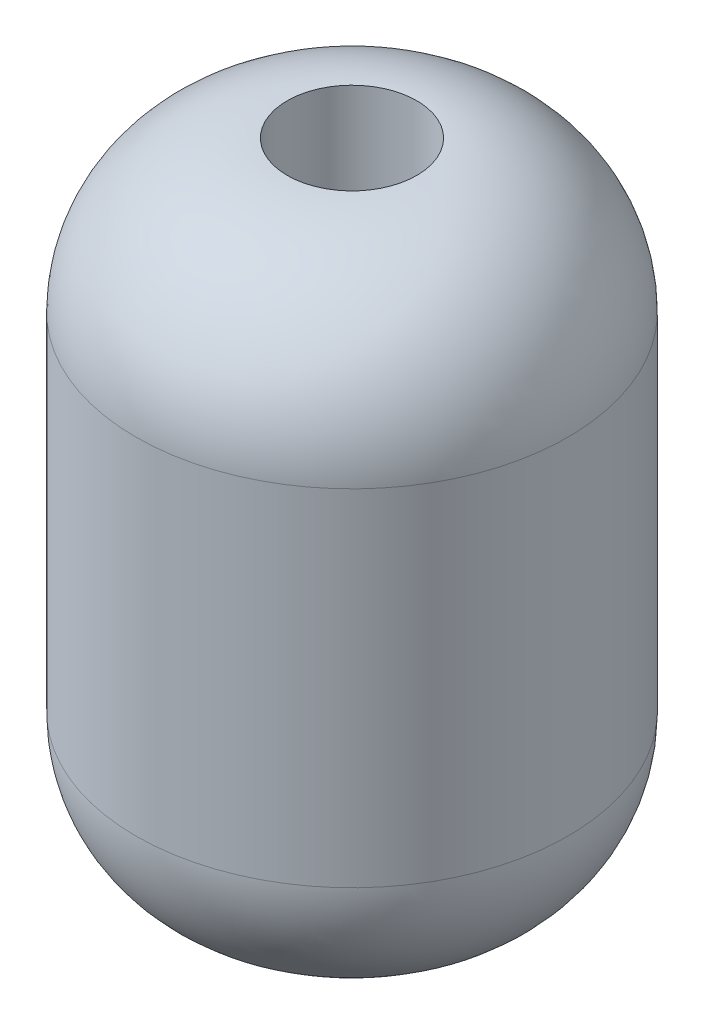
ISO-10303-21;
HEADER;
FILE_DESCRIPTION(('STEP AP214'),'2;1');
FILE_NAME('part.step','',(''),(''),'','','');
FILE_SCHEMA(('AUTOMOTIVE_DESIGN { 1 0 10303 214 1 1 1 1 }'));
ENDSEC;
DATA;
#1=APPLICATION_CONTEXT('core data for automotive mechanical design processes');
#2=APPLICATION_PROTOCOL_DEFINITION('international standard','automotive_design',2000,#1);
#3=PRODUCT_CONTEXT('',#1,'mechanical');
#4=PRODUCT('Part','Part','',(#3));
#5=PRODUCT_RELATED_PRODUCT_CATEGORY('part','',(#4));
#6=PRODUCT_DEFINITION_FORMATION('','',#4);
#7=PRODUCT_DEFINITION_CONTEXT('part definition',#1,'design');
#8=PRODUCT_DEFINITION('design','',#6,#7);
#9=PRODUCT_DEFINITION_SHAPE('','',#8);
#10=(LENGTH_UNIT() NAMED_UNIT(*) SI_UNIT(.MILLI.,.METRE.));
#11=(NAMED_UNIT(*) PLANE_ANGLE_UNIT() SI_UNIT($,.RADIAN.));
#12=(NAMED_UNIT(*) SI_UNIT($,.STERADIAN.) SOLID_ANGLE_UNIT());
#13=UNCERTAINTY_MEASURE_WITH_UNIT(LENGTH_MEASURE(1.E-05),#10,'distance_accuracy_value','');
#14=(GEOMETRIC_REPRESENTATION_CONTEXT(3) GLOBAL_UNCERTAINTY_ASSIGNED_CONTEXT((#13)) GLOBAL_UNIT_ASSIGNED_CONTEXT((#10,
#11,#12)) REPRESENTATION_CONTEXT('',''));
#15=CARTESIAN_POINT('',(0.,0.,0.));
#16=DIRECTION('',(0.,0.,1.));
#17=DIRECTION('',(1.,0.,0.));
#18=AXIS2_PLACEMENT_3D('',#15,#16,#17);
#19=CARTESIAN_POINT('',(0.,6.,0.));
#20=DIRECTION('',(0.,-1.,0.));
#21=DIRECTION('',(0.,0.,-1.));
#22=AXIS2_PLACEMENT_3D('',#19,#20,#21);
#23=CYLINDRICAL_SURFACE('',#22,2.);
#24=CARTESIAN_POINT('',(0.,1.4,0.));
#25=DIRECTION('',(0.,1.,0.));
#26=DIRECTION('',(0.,0.,1.));
#27=AXIS2_PLACEMENT_3D('',#24,#25,#26);
#28=CIRCLE('',#27,2.);
#29=CARTESIAN_POINT('',(0.,1.4,2.));
#30=VERTEX_POINT('',#29);
#31=EDGE_CURVE('E10',#30,#30,#28,.T.);
#32=ORIENTED_EDGE('',*,*,#31,.T.);
#33=EDGE_LOOP('',(#32));
#34=FACE_BOUND('',#33,.T.);
#35=CARTESIAN_POINT('',(0.,4.6,0.));
#36=DIRECTION('',(0.,1.,0.));
#37=DIRECTION('',(0.,0.,1.));
#38=AXIS2_PLACEMENT_3D('',#35,#36,#37);
#39=CIRCLE('',#38,2.);
#40=CARTESIAN_POINT('',(0.,4.6,2.));
#41=VERTEX_POINT('',#40);
#42=EDGE_CURVE('E44',#41,#41,#39,.F.);
#43=ORIENTED_EDGE('',*,*,#42,.T.);
#44=EDGE_LOOP('',(#43));
#45=FACE_BOUND('',#44,.T.);
#46=ADVANCED_FACE('F37',(#34,#45),#23,.T.);
#47=CARTESIAN_POINT('',(0.,6.,0.));
#48=DIRECTION('',(0.,-1.,0.));
#49=DIRECTION('',(0.,0.,-1.));
#50=AXIS2_PLACEMENT_3D('',#47,#48,#49);
#51=CYLINDRICAL_SURFACE('',#50,0.6);
#52=CARTESIAN_POINT('',(0.,6.,0.));
#53=DIRECTION('',(0.,1.,0.));
#54=DIRECTION('',(0.,0.,1.));
#55=AXIS2_PLACEMENT_3D('',#52,#53,#54);
#56=CIRCLE('',#55,0.6);
#57=CARTESIAN_POINT('',(0.,6.,0.6));
#58=VERTEX_POINT('',#57);
#59=EDGE_CURVE('E48',#58,#58,#56,.T.);
#60=ORIENTED_EDGE('',*,*,#59,.T.);
#61=EDGE_LOOP('',(#60));
#62=FACE_BOUND('',#61,.T.);
#63=CARTESIAN_POINT('',(0.,0.,0.));
#64=DIRECTION('',(0.,1.,0.));
#65=DIRECTION('',(0.,0.,1.));
#66=AXIS2_PLACEMENT_3D('',#63,#64,#65);
#67=CIRCLE('',#66,0.6);
#68=CARTESIAN_POINT('',(0.,0.,0.6));
#69=VERTEX_POINT('',#68);
#70=EDGE_CURVE('E52',#69,#69,#67,.T.);
#71=ORIENTED_EDGE('',*,*,#70,.F.);
#72=EDGE_LOOP('',(#71));
#73=FACE_BOUND('',#72,.T.);
#74=ADVANCED_FACE('F61',(#62,#73),#51,.F.);
#75=CARTESIAN_POINT('',(0.,1.4,0.));
#76=DIRECTION('',(0.,1.,0.));
#77=DIRECTION('',(0.,0.,1.));
#78=AXIS2_PLACEMENT_3D('',#75,#76,#77);
#79=DEGENERATE_TOROIDAL_SURFACE('',#78,0.6,1.4,.T.);
#80=ORIENTED_EDGE('',*,*,#70,.T.);
#81=EDGE_LOOP('',(#80));
#82=FACE_BOUND('',#81,.T.);
#83=ORIENTED_EDGE('',*,*,#31,.F.);
#84=EDGE_LOOP('',(#83));
#85=FACE_BOUND('',#84,.T.);
#86=ADVANCED_FACE('F58',(#82,#85),#79,.T.);
#87=CARTESIAN_POINT('',(0.,4.6,0.));
#88=DIRECTION('',(0.,1.,0.));
#89=DIRECTION('',(0.,0.,1.));
#90=AXIS2_PLACEMENT_3D('',#87,#88,#89);
#91=DEGENERATE_TOROIDAL_SURFACE('',#90,0.6,1.4,.T.);
#92=ORIENTED_EDGE('',*,*,#42,.F.);
#93=EDGE_LOOP('',(#92));
#94=FACE_BOUND('',#93,.T.);
#95=ORIENTED_EDGE('',*,*,#59,.F.);
#96=EDGE_LOOP('',(#95));
#97=FACE_BOUND('',#96,.T.);
#98=ADVANCED_FACE('F39',(#94,#97),#91,.T.);
#99=CLOSED_SHELL('',(#46,#74,#86,#98));
#100=MANIFOLD_SOLID_BREP('B2',#99);
#101=ADVANCED_BREP_SHAPE_REPRESENTATION('',(#18,#100),#14);
#102=SHAPE_DEFINITION_REPRESENTATION(#9,#101);
ENDSEC;
END-ISO-10303-21;
